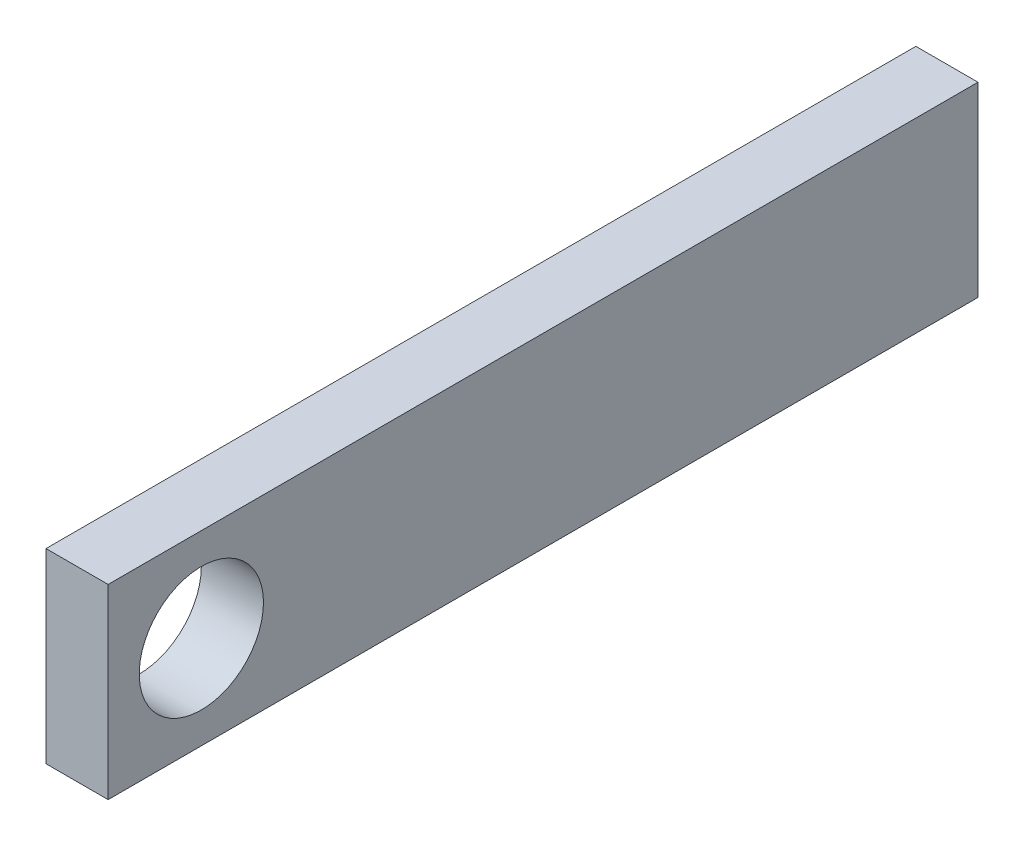
ISO-10303-21;
HEADER;
FILE_DESCRIPTION(('STEP AP214'),'2;1');
FILE_NAME('part.step','',(''),(''),'','','');
FILE_SCHEMA(('AUTOMOTIVE_DESIGN { 1 0 10303 214 1 1 1 1 }'));
ENDSEC;
DATA;
#1=APPLICATION_CONTEXT('core data for automotive mechanical design processes');
#2=APPLICATION_PROTOCOL_DEFINITION('international standard','automotive_design',2000,#1);
#3=PRODUCT_CONTEXT('',#1,'mechanical');
#4=PRODUCT('Part','Part','',(#3));
#5=PRODUCT_RELATED_PRODUCT_CATEGORY('part','',(#4));
#6=PRODUCT_DEFINITION_FORMATION('','',#4);
#7=PRODUCT_DEFINITION_CONTEXT('part definition',#1,'design');
#8=PRODUCT_DEFINITION('design','',#6,#7);
#9=PRODUCT_DEFINITION_SHAPE('','',#8);
#10=(LENGTH_UNIT() NAMED_UNIT(*) SI_UNIT(.MILLI.,.METRE.));
#11=(NAMED_UNIT(*) PLANE_ANGLE_UNIT() SI_UNIT($,.RADIAN.));
#12=(NAMED_UNIT(*) SI_UNIT($,.STERADIAN.) SOLID_ANGLE_UNIT());
#13=UNCERTAINTY_MEASURE_WITH_UNIT(LENGTH_MEASURE(1.E-05),#10,'distance_accuracy_value','');
#14=(GEOMETRIC_REPRESENTATION_CONTEXT(3) GLOBAL_UNCERTAINTY_ASSIGNED_CONTEXT((#13)) GLOBAL_UNIT_ASSIGNED_CONTEXT((#10,
#11,#12)) REPRESENTATION_CONTEXT('',''));
#15=CARTESIAN_POINT('',(0.,0.,0.));
#16=DIRECTION('',(0.,0.,1.));
#17=DIRECTION('',(1.,0.,0.));
#18=AXIS2_PLACEMENT_3D('',#15,#16,#17);
#19=CARTESIAN_POINT('',(10.,0.,0.));
#20=DIRECTION('',(-1.,0.,0.));
#21=DIRECTION('',(0.,0.,1.));
#22=AXIS2_PLACEMENT_3D('',#19,#20,#21);
#23=PLANE('',#22);
#24=DIRECTION('',(0.,-1.,0.));
#25=VECTOR('',#24,1.);
#26=CARTESIAN_POINT('',(10.,-15.,15.));
#27=LINE('',#26,#25);
#28=CARTESIAN_POINT('',(10.,15.,15.));
#29=VERTEX_POINT('',#28);
#30=CARTESIAN_POINT('',(10.,-15.,15.));
#31=VERTEX_POINT('',#30);
#32=EDGE_CURVE('E89',#29,#31,#27,.T.);
#33=ORIENTED_EDGE('',*,*,#32,.T.);
#34=DIRECTION('',(0.,0.,-1.));
#35=VECTOR('',#34,1.);
#36=CARTESIAN_POINT('',(10.,-15.,15.));
#37=LINE('',#36,#35);
#38=CARTESIAN_POINT('',(10.,-15.,-125.));
#39=VERTEX_POINT('',#38);
#40=EDGE_CURVE('E84',#31,#39,#37,.T.);
#41=ORIENTED_EDGE('',*,*,#40,.T.);
#42=DIRECTION('',(0.,1.,0.));
#43=VECTOR('',#42,1.);
#44=CARTESIAN_POINT('',(10.,-15.,-125.));
#45=LINE('',#44,#43);
#46=CARTESIAN_POINT('',(10.,15.,-125.));
#47=VERTEX_POINT('',#46);
#48=EDGE_CURVE('E87',#39,#47,#45,.T.);
#49=ORIENTED_EDGE('',*,*,#48,.T.);
#50=DIRECTION('',(0.,0.,1.));
#51=VECTOR('',#50,1.);
#52=CARTESIAN_POINT('',(10.,15.,15.));
#53=LINE('',#52,#51);
#54=EDGE_CURVE('E54',#47,#29,#53,.T.);
#55=ORIENTED_EDGE('',*,*,#54,.T.);
#56=EDGE_LOOP('',(#33,#41,#49,#55));
#57=FACE_BOUND('',#56,.T.);
#58=CARTESIAN_POINT('',(10.,0.,0.));
#59=DIRECTION('',(1.,0.,0.));
#60=DIRECTION('',(0.,0.,-1.));
#61=AXIS2_PLACEMENT_3D('',#58,#59,#60);
#62=CIRCLE('',#61,10.);
#63=CARTESIAN_POINT('',(10.,0.,-10.));
#64=VERTEX_POINT('',#63);
#65=EDGE_CURVE('E104',#64,#64,#62,.T.);
#66=ORIENTED_EDGE('',*,*,#65,.F.);
#67=EDGE_LOOP('',(#66));
#68=FACE_BOUND('',#67,.T.);
#69=ADVANCED_FACE('F37',(#57,#68),#23,.F.);
#70=CARTESIAN_POINT('',(0.,0.,0.));
#71=DIRECTION('',(-1.,0.,0.));
#72=DIRECTION('',(0.,0.,1.));
#73=AXIS2_PLACEMENT_3D('',#70,#71,#72);
#74=PLANE('',#73);
#75=DIRECTION('',(0.,-1.,0.));
#76=VECTOR('',#75,1.);
#77=CARTESIAN_POINT('',(0.,-15.,15.));
#78=LINE('',#77,#76);
#79=CARTESIAN_POINT('',(0.,15.,15.));
#80=VERTEX_POINT('',#79);
#81=CARTESIAN_POINT('',(0.,-15.,15.));
#82=VERTEX_POINT('',#81);
#83=EDGE_CURVE('E101',#80,#82,#78,.T.);
#84=ORIENTED_EDGE('',*,*,#83,.F.);
#85=DIRECTION('',(0.,0.,1.));
#86=VECTOR('',#85,1.);
#87=CARTESIAN_POINT('',(0.,15.,15.));
#88=LINE('',#87,#86);
#89=CARTESIAN_POINT('',(0.,15.,-125.));
#90=VERTEX_POINT('',#89);
#91=EDGE_CURVE('E77',#90,#80,#88,.T.);
#92=ORIENTED_EDGE('',*,*,#91,.F.);
#93=DIRECTION('',(0.,1.,0.));
#94=VECTOR('',#93,1.);
#95=CARTESIAN_POINT('',(0.,-15.,-125.));
#96=LINE('',#95,#94);
#97=CARTESIAN_POINT('',(0.,-15.,-125.));
#98=VERTEX_POINT('',#97);
#99=EDGE_CURVE('E71',#98,#90,#96,.T.);
#100=ORIENTED_EDGE('',*,*,#99,.F.);
#101=DIRECTION('',(0.,0.,-1.));
#102=VECTOR('',#101,1.);
#103=CARTESIAN_POINT('',(0.,-15.,15.));
#104=LINE('',#103,#102);
#105=EDGE_CURVE('E93',#82,#98,#104,.T.);
#106=ORIENTED_EDGE('',*,*,#105,.F.);
#107=EDGE_LOOP('',(#84,#92,#100,#106));
#108=FACE_BOUND('',#107,.T.);
#109=CARTESIAN_POINT('',(0.,0.,0.));
#110=DIRECTION('',(1.,0.,0.));
#111=DIRECTION('',(0.,0.,-1.));
#112=AXIS2_PLACEMENT_3D('',#109,#110,#111);
#113=CIRCLE('',#112,10.);
#114=CARTESIAN_POINT('',(0.,0.,-10.));
#115=VERTEX_POINT('',#114);
#116=EDGE_CURVE('E116',#115,#115,#113,.T.);
#117=ORIENTED_EDGE('',*,*,#116,.T.);
#118=EDGE_LOOP('',(#117));
#119=FACE_BOUND('',#118,.T.);
#120=ADVANCED_FACE('F112',(#108,#119),#74,.T.);
#121=CARTESIAN_POINT('',(10.,-15.,15.));
#122=DIRECTION('',(0.,0.,-1.));
#123=DIRECTION('',(-1.,0.,0.));
#124=AXIS2_PLACEMENT_3D('',#121,#122,#123);
#125=PLANE('',#124);
#126=ORIENTED_EDGE('',*,*,#83,.T.);
#127=DIRECTION('',(-1.,0.,0.));
#128=VECTOR('',#127,1.);
#129=CARTESIAN_POINT('',(10.,-15.,15.));
#130=LINE('',#129,#128);
#131=EDGE_CURVE('E11',#31,#82,#130,.T.);
#132=ORIENTED_EDGE('',*,*,#131,.F.);
#133=ORIENTED_EDGE('',*,*,#32,.F.);
#134=DIRECTION('',(-1.,0.,0.));
#135=VECTOR('',#134,1.);
#136=CARTESIAN_POINT('',(10.,15.,15.));
#137=LINE('',#136,#135);
#138=EDGE_CURVE('E97',#29,#80,#137,.T.);
#139=ORIENTED_EDGE('',*,*,#138,.T.);
#140=EDGE_LOOP('',(#126,#132,#133,#139));
#141=FACE_BOUND('',#140,.T.);
#142=ADVANCED_FACE('F39',(#141),#125,.F.);
#143=CARTESIAN_POINT('',(10.,-15.,15.));
#144=DIRECTION('',(0.,1.,0.));
#145=DIRECTION('',(0.,0.,1.));
#146=AXIS2_PLACEMENT_3D('',#143,#144,#145);
#147=PLANE('',#146);
#148=ORIENTED_EDGE('',*,*,#105,.T.);
#149=DIRECTION('',(-1.,0.,0.));
#150=VECTOR('',#149,1.);
#151=CARTESIAN_POINT('',(10.,-15.,-125.));
#152=LINE('',#151,#150);
#153=EDGE_CURVE('E46',#39,#98,#152,.T.);
#154=ORIENTED_EDGE('',*,*,#153,.F.);
#155=ORIENTED_EDGE('',*,*,#40,.F.);
#156=ORIENTED_EDGE('',*,*,#131,.T.);
#157=EDGE_LOOP('',(#148,#154,#155,#156));
#158=FACE_BOUND('',#157,.T.);
#159=ADVANCED_FACE('F92',(#158),#147,.F.);
#160=CARTESIAN_POINT('',(10.,-15.,-125.));
#161=DIRECTION('',(0.,0.,1.));
#162=DIRECTION('',(1.,0.,0.));
#163=AXIS2_PLACEMENT_3D('',#160,#161,#162);
#164=PLANE('',#163);
#165=ORIENTED_EDGE('',*,*,#99,.T.);
#166=DIRECTION('',(-1.,0.,0.));
#167=VECTOR('',#166,1.);
#168=CARTESIAN_POINT('',(10.,15.,-125.));
#169=LINE('',#168,#167);
#170=EDGE_CURVE('E94',#47,#90,#169,.T.);
#171=ORIENTED_EDGE('',*,*,#170,.F.);
#172=ORIENTED_EDGE('',*,*,#48,.F.);
#173=ORIENTED_EDGE('',*,*,#153,.T.);
#174=EDGE_LOOP('',(#165,#171,#172,#173));
#175=FACE_BOUND('',#174,.T.);
#176=ADVANCED_FACE('F95',(#175),#164,.F.);
#177=CARTESIAN_POINT('',(10.,15.,15.));
#178=DIRECTION('',(0.,-1.,0.));
#179=DIRECTION('',(0.,0.,-1.));
#180=AXIS2_PLACEMENT_3D('',#177,#178,#179);
#181=PLANE('',#180);
#182=ORIENTED_EDGE('',*,*,#91,.T.);
#183=ORIENTED_EDGE('',*,*,#138,.F.);
#184=ORIENTED_EDGE('',*,*,#54,.F.);
#185=ORIENTED_EDGE('',*,*,#170,.T.);
#186=EDGE_LOOP('',(#182,#183,#184,#185));
#187=FACE_BOUND('',#186,.T.);
#188=ADVANCED_FACE('F109',(#187),#181,.F.);
#189=CARTESIAN_POINT('',(10.,0.,0.));
#190=DIRECTION('',(-1.,0.,0.));
#191=DIRECTION('',(0.,0.,1.));
#192=AXIS2_PLACEMENT_3D('',#189,#190,#191);
#193=CYLINDRICAL_SURFACE('',#192,10.);
#194=ORIENTED_EDGE('',*,*,#65,.T.);
#195=EDGE_LOOP('',(#194));
#196=FACE_BOUND('',#195,.T.);
#197=ORIENTED_EDGE('',*,*,#116,.F.);
#198=EDGE_LOOP('',(#197));
#199=FACE_BOUND('',#198,.T.);
#200=ADVANCED_FACE('F122',(#196,#199),#193,.F.);
#201=CLOSED_SHELL('',(#69,#120,#142,#159,#176,#188,#200));
#202=MANIFOLD_SOLID_BREP('B2',#201);
#203=ADVANCED_BREP_SHAPE_REPRESENTATION('',(#18,#202),#14);
#204=SHAPE_DEFINITION_REPRESENTATION(#9,#203);
ENDSEC;
END-ISO-10303-21;
